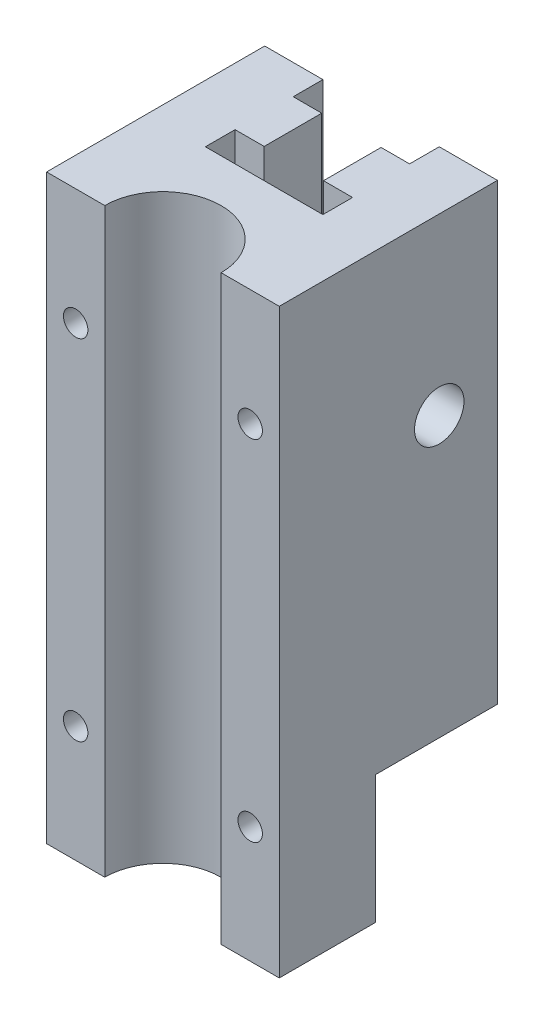
ISO-10303-21;
HEADER;
FILE_DESCRIPTION(('STEP AP214'),'2;1');
FILE_NAME('part.step','',(''),(''),'','','');
FILE_SCHEMA(('AUTOMOTIVE_DESIGN { 1 0 10303 214 1 1 1 1 }'));
ENDSEC;
DATA;
#1=APPLICATION_CONTEXT('core data for automotive mechanical design processes');
#2=APPLICATION_PROTOCOL_DEFINITION('international standard','automotive_design',2000,#1);
#3=PRODUCT_CONTEXT('',#1,'mechanical');
#4=PRODUCT('Part','Part','',(#3));
#5=PRODUCT_RELATED_PRODUCT_CATEGORY('part','',(#4));
#6=PRODUCT_DEFINITION_FORMATION('','',#4);
#7=PRODUCT_DEFINITION_CONTEXT('part definition',#1,'design');
#8=PRODUCT_DEFINITION('design','',#6,#7);
#9=PRODUCT_DEFINITION_SHAPE('','',#8);
#10=(LENGTH_UNIT() NAMED_UNIT(*) SI_UNIT(.MILLI.,.METRE.));
#11=(NAMED_UNIT(*) PLANE_ANGLE_UNIT() SI_UNIT($,.RADIAN.));
#12=(NAMED_UNIT(*) SI_UNIT($,.STERADIAN.) SOLID_ANGLE_UNIT());
#13=UNCERTAINTY_MEASURE_WITH_UNIT(LENGTH_MEASURE(1.E-05),#10,'distance_accuracy_value','');
#14=(GEOMETRIC_REPRESENTATION_CONTEXT(3) GLOBAL_UNCERTAINTY_ASSIGNED_CONTEXT((#13)) GLOBAL_UNIT_ASSIGNED_CONTEXT((#10,
#11,#12)) REPRESENTATION_CONTEXT('',''));
#15=CARTESIAN_POINT('',(0.,0.,0.));
#16=DIRECTION('',(0.,0.,1.));
#17=DIRECTION('',(1.,0.,0.));
#18=AXIS2_PLACEMENT_3D('',#15,#16,#17);
#19=CARTESIAN_POINT('',(-20.,-30.,10.));
#20=DIRECTION('',(1.,0.,0.));
#21=DIRECTION('',(0.,0.,-1.));
#22=AXIS2_PLACEMENT_3D('',#19,#20,#21);
#23=CYLINDRICAL_SURFACE('',#22,2.5);
#24=CARTESIAN_POINT('',(-5.1,-30.,10.));
#25=DIRECTION('',(-1.,0.,0.));
#26=DIRECTION('',(0.,0.,1.));
#27=AXIS2_PLACEMENT_3D('',#24,#25,#26);
#28=CIRCLE('',#27,2.5);
#29=CARTESIAN_POINT('',(-5.1,-30.,12.5));
#30=VERTEX_POINT('',#29);
#31=EDGE_CURVE('E340',#30,#30,#28,.T.);
#32=ORIENTED_EDGE('',*,*,#31,.F.);
#33=EDGE_LOOP('',(#32));
#34=FACE_BOUND('',#33,.T.);
#35=CARTESIAN_POINT('',(-17.,-30.,10.));
#36=DIRECTION('',(-1.,0.,0.));
#37=DIRECTION('',(0.,0.,1.));
#38=AXIS2_PLACEMENT_3D('',#35,#36,#37);
#39=CIRCLE('',#38,2.5);
#40=CARTESIAN_POINT('',(-17.,-30.,12.5));
#41=VERTEX_POINT('',#40);
#42=EDGE_CURVE('E249',#41,#41,#39,.T.);
#43=ORIENTED_EDGE('',*,*,#42,.T.);
#44=EDGE_LOOP('',(#43));
#45=FACE_BOUND('',#44,.T.);
#46=ADVANCED_FACE('F43',(#34,#45),#23,.F.);
#47=CARTESIAN_POINT('',(5.1,-30.,10.));
#48=DIRECTION('',(-1.,0.,0.));
#49=DIRECTION('',(0.,0.,1.));
#50=AXIS2_PLACEMENT_3D('',#47,#48,#49);
#51=CIRCLE('',#50,2.5);
#52=CARTESIAN_POINT('',(5.1,-30.,12.5));
#53=VERTEX_POINT('',#52);
#54=EDGE_CURVE('E333',#53,#53,#51,.T.);
#55=ORIENTED_EDGE('',*,*,#54,.T.);
#56=EDGE_LOOP('',(#55));
#57=FACE_BOUND('',#56,.T.);
#58=CARTESIAN_POINT('',(14.,-30.,10.));
#59=DIRECTION('',(1.,0.,0.));
#60=DIRECTION('',(0.,0.,-1.));
#61=AXIS2_PLACEMENT_3D('',#58,#59,#60);
#62=CIRCLE('',#61,2.5);
#63=CARTESIAN_POINT('',(14.,-30.,7.5));
#64=VERTEX_POINT('',#63);
#65=EDGE_CURVE('E325',#64,#64,#62,.T.);
#66=ORIENTED_EDGE('',*,*,#65,.T.);
#67=EDGE_LOOP('',(#66));
#68=FACE_BOUND('',#67,.T.);
#69=ADVANCED_FACE('F592',(#57,#68),#23,.F.);
#70=CARTESIAN_POINT('',(0.,-100.,0.));
#71=DIRECTION('',(0.,0.,-1.));
#72=DIRECTION('',(-1.,0.,0.));
#73=AXIS2_PLACEMENT_3D('',#70,#71,#72);
#74=PLANE('',#73);
#75=DIRECTION('',(0.,1.,0.));
#76=VECTOR('',#75,1.);
#77=CARTESIAN_POINT('',(-10.,-100.,0.));
#78=LINE('',#77,#76);
#79=CARTESIAN_POINT('',(-10.,-78.,0.));
#80=VERTEX_POINT('',#79);
#81=CARTESIAN_POINT('',(-10.,0.,0.));
#82=VERTEX_POINT('',#81);
#83=EDGE_CURVE('E496',#80,#82,#78,.T.);
#84=ORIENTED_EDGE('',*,*,#83,.F.);
#85=DIRECTION('',(1.,0.,0.));
#86=VECTOR('',#85,1.);
#87=CARTESIAN_POINT('',(20.,-78.,0.));
#88=LINE('',#87,#86);
#89=CARTESIAN_POINT('',(-20.,-78.,0.));
#90=VERTEX_POINT('',#89);
#91=EDGE_CURVE('E357',#90,#80,#88,.T.);
#92=ORIENTED_EDGE('',*,*,#91,.F.);
#93=DIRECTION('',(0.,1.,0.));
#94=VECTOR('',#93,1.);
#95=CARTESIAN_POINT('',(-20.,-100.,0.));
#96=LINE('',#95,#94);
#97=CARTESIAN_POINT('',(-20.,0.,0.));
#98=VERTEX_POINT('',#97);
#99=EDGE_CURVE('E493',#90,#98,#96,.T.);
#100=ORIENTED_EDGE('',*,*,#99,.T.);
#101=DIRECTION('',(-1.,0.,0.));
#102=VECTOR('',#101,1.);
#103=CARTESIAN_POINT('',(0.,0.,0.));
#104=LINE('',#103,#102);
#105=EDGE_CURVE('E483',#82,#98,#104,.T.);
#106=ORIENTED_EDGE('',*,*,#105,.F.);
#107=EDGE_LOOP('',(#84,#92,#100,#106));
#108=FACE_BOUND('',#107,.T.);
#109=ADVANCED_FACE('F598',(#108),#74,.T.);
#110=CARTESIAN_POINT('',(-10.,-100.,0.));
#111=DIRECTION('',(-1.,0.,0.));
#112=DIRECTION('',(0.,0.,1.));
#113=AXIS2_PLACEMENT_3D('',#110,#111,#112);
#114=PLANE('',#113);
#115=DIRECTION('',(0.,0.,1.));
#116=VECTOR('',#115,1.);
#117=CARTESIAN_POINT('',(-10.,-78.,0.));
#118=LINE('',#117,#116);
#119=CARTESIAN_POINT('',(-10.,-78.,5.1));
#120=VERTEX_POINT('',#119);
#121=EDGE_CURVE('E404',#80,#120,#118,.T.);
#122=ORIENTED_EDGE('',*,*,#121,.F.);
#123=ORIENTED_EDGE('',*,*,#83,.T.);
#124=DIRECTION('',(0.,0.,1.));
#125=VECTOR('',#124,1.);
#126=CARTESIAN_POINT('',(-10.,0.,0.));
#127=LINE('',#126,#125);
#128=CARTESIAN_POINT('',(-10.,0.,5.1));
#129=VERTEX_POINT('',#128);
#130=EDGE_CURVE('E479',#82,#129,#127,.T.);
#131=ORIENTED_EDGE('',*,*,#130,.T.);
#132=DIRECTION('',(0.,1.,0.));
#133=VECTOR('',#132,1.);
#134=CARTESIAN_POINT('',(-10.,-100.,5.1));
#135=LINE('',#134,#133);
#136=EDGE_CURVE('E499',#120,#129,#135,.T.);
#137=ORIENTED_EDGE('',*,*,#136,.F.);
#138=EDGE_LOOP('',(#122,#123,#131,#137));
#139=FACE_BOUND('',#138,.T.);
#140=ADVANCED_FACE('F812',(#139),#114,.F.);
#141=CARTESIAN_POINT('',(0.,-100.,5.1));
#142=DIRECTION('',(0.,0.,1.));
#143=DIRECTION('',(1.,0.,0.));
#144=AXIS2_PLACEMENT_3D('',#141,#142,#143);
#145=PLANE('',#144);
#146=DIRECTION('',(1.,0.,0.));
#147=VECTOR('',#146,1.);
#148=CARTESIAN_POINT('',(0.,-78.,5.1));
#149=LINE('',#148,#147);
#150=CARTESIAN_POINT('',(-5.1,-78.,5.1));
#151=VERTEX_POINT('',#150);
#152=EDGE_CURVE('E401',#120,#151,#149,.T.);
#153=ORIENTED_EDGE('',*,*,#152,.F.);
#154=ORIENTED_EDGE('',*,*,#136,.T.);
#155=DIRECTION('',(1.,0.,0.));
#156=VECTOR('',#155,1.);
#157=CARTESIAN_POINT('',(0.,0.,5.1));
#158=LINE('',#157,#156);
#159=CARTESIAN_POINT('',(-5.1,0.,5.1));
#160=VERTEX_POINT('',#159);
#161=EDGE_CURVE('E475',#129,#160,#158,.T.);
#162=ORIENTED_EDGE('',*,*,#161,.T.);
#163=DIRECTION('',(0.,1.,0.));
#164=VECTOR('',#163,1.);
#165=CARTESIAN_POINT('',(-5.1,-100.,5.1));
#166=LINE('',#165,#164);
#167=EDGE_CURVE('E502',#151,#160,#166,.T.);
#168=ORIENTED_EDGE('',*,*,#167,.F.);
#169=EDGE_LOOP('',(#153,#154,#162,#168));
#170=FACE_BOUND('',#169,.T.);
#171=ADVANCED_FACE('F821',(#170),#145,.F.);
#172=CARTESIAN_POINT('',(-5.1,-100.,0.));
#173=DIRECTION('',(-1.,0.,0.));
#174=DIRECTION('',(0.,0.,1.));
#175=AXIS2_PLACEMENT_3D('',#172,#173,#174);
#176=PLANE('',#175);
#177=ORIENTED_EDGE('',*,*,#31,.T.);
#178=EDGE_LOOP('',(#177));
#179=FACE_BOUND('',#178,.T.);
#180=DIRECTION('',(0.,0.,1.));
#181=VECTOR('',#180,1.);
#182=CARTESIAN_POINT('',(-5.1,-78.,0.));
#183=LINE('',#182,#181);
#184=CARTESIAN_POINT('',(-5.1,-78.,15.));
#185=VERTEX_POINT('',#184);
#186=EDGE_CURVE('E398',#151,#185,#183,.T.);
#187=ORIENTED_EDGE('',*,*,#186,.F.);
#188=ORIENTED_EDGE('',*,*,#167,.T.);
#189=DIRECTION('',(0.,0.,1.));
#190=VECTOR('',#189,1.);
#191=CARTESIAN_POINT('',(-5.1,0.,0.));
#192=LINE('',#191,#190);
#193=CARTESIAN_POINT('',(-5.1,0.,15.));
#194=VERTEX_POINT('',#193);
#195=EDGE_CURVE('E471',#160,#194,#192,.T.);
#196=ORIENTED_EDGE('',*,*,#195,.T.);
#197=DIRECTION('',(0.,1.,0.));
#198=VECTOR('',#197,1.);
#199=CARTESIAN_POINT('',(-5.1,-100.,15.));
#200=LINE('',#199,#198);
#201=EDGE_CURVE('E505',#185,#194,#200,.T.);
#202=ORIENTED_EDGE('',*,*,#201,.F.);
#203=EDGE_LOOP('',(#187,#188,#196,#202));
#204=FACE_BOUND('',#203,.T.);
#205=ADVANCED_FACE('F830',(#179,#204),#176,.F.);
#206=CARTESIAN_POINT('',(0.,-100.,15.));
#207=DIRECTION('',(0.,0.,-1.));
#208=DIRECTION('',(-1.,0.,0.));
#209=AXIS2_PLACEMENT_3D('',#206,#207,#208);
#210=PLANE('',#209);
#211=DIRECTION('',(-1.,0.,0.));
#212=VECTOR('',#211,1.);
#213=CARTESIAN_POINT('',(0.,-78.,15.));
#214=LINE('',#213,#212);
#215=CARTESIAN_POINT('',(-10.1,-78.,15.));
#216=VERTEX_POINT('',#215);
#217=EDGE_CURVE('E395',#185,#216,#214,.T.);
#218=ORIENTED_EDGE('',*,*,#217,.F.);
#219=ORIENTED_EDGE('',*,*,#201,.T.);
#220=DIRECTION('',(-1.,0.,0.));
#221=VECTOR('',#220,1.);
#222=CARTESIAN_POINT('',(0.,0.,15.));
#223=LINE('',#222,#221);
#224=CARTESIAN_POINT('',(-10.1,0.,15.));
#225=VERTEX_POINT('',#224);
#226=EDGE_CURVE('E467',#194,#225,#223,.T.);
#227=ORIENTED_EDGE('',*,*,#226,.T.);
#228=DIRECTION('',(0.,1.,0.));
#229=VECTOR('',#228,1.);
#230=CARTESIAN_POINT('',(-10.1,-100.,15.));
#231=LINE('',#230,#229);
#232=EDGE_CURVE('E508',#216,#225,#231,.T.);
#233=ORIENTED_EDGE('',*,*,#232,.F.);
#234=EDGE_LOOP('',(#218,#219,#227,#233));
#235=FACE_BOUND('',#234,.T.);
#236=ADVANCED_FACE('F839',(#235),#210,.F.);
#237=CARTESIAN_POINT('',(-10.1,-100.,0.));
#238=DIRECTION('',(-1.,0.,0.));
#239=DIRECTION('',(0.,0.,1.));
#240=AXIS2_PLACEMENT_3D('',#237,#238,#239);
#241=PLANE('',#240);
#242=DIRECTION('',(0.,0.,1.));
#243=VECTOR('',#242,1.);
#244=CARTESIAN_POINT('',(-10.1,-78.,0.));
#245=LINE('',#244,#243);
#246=CARTESIAN_POINT('',(-10.1,-78.,20.1));
#247=VERTEX_POINT('',#246);
#248=EDGE_CURVE('E392',#216,#247,#245,.T.);
#249=ORIENTED_EDGE('',*,*,#248,.F.);
#250=ORIENTED_EDGE('',*,*,#232,.T.);
#251=DIRECTION('',(0.,0.,1.));
#252=VECTOR('',#251,1.);
#253=CARTESIAN_POINT('',(-10.1,0.,0.));
#254=LINE('',#253,#252);
#255=CARTESIAN_POINT('',(-10.1,0.,20.1));
#256=VERTEX_POINT('',#255);
#257=EDGE_CURVE('E463',#225,#256,#254,.T.);
#258=ORIENTED_EDGE('',*,*,#257,.T.);
#259=DIRECTION('',(0.,1.,0.));
#260=VECTOR('',#259,1.);
#261=CARTESIAN_POINT('',(-10.1,-100.,20.1));
#262=LINE('',#261,#260);
#263=EDGE_CURVE('E511',#247,#256,#262,.T.);
#264=ORIENTED_EDGE('',*,*,#263,.F.);
#265=EDGE_LOOP('',(#249,#250,#258,#264));
#266=FACE_BOUND('',#265,.T.);
#267=ADVANCED_FACE('F847',(#266),#241,.F.);
#268=CARTESIAN_POINT('',(0.,-100.,20.1));
#269=DIRECTION('',(0.,0.,-1.));
#270=DIRECTION('',(-1.,0.,0.));
#271=AXIS2_PLACEMENT_3D('',#268,#269,#270);
#272=PLANE('',#271);
#273=DIRECTION('',(0.,1.,0.));
#274=VECTOR('',#273,1.);
#275=CARTESIAN_POINT('',(10.1,-100.,20.1));
#276=LINE('',#275,#274);
#277=CARTESIAN_POINT('',(10.1,-78.,20.1));
#278=VERTEX_POINT('',#277);
#279=CARTESIAN_POINT('',(10.1,0.,20.1));
#280=VERTEX_POINT('',#279);
#281=EDGE_CURVE('E514',#278,#280,#276,.T.);
#282=ORIENTED_EDGE('',*,*,#281,.F.);
#283=DIRECTION('',(-1.,0.,0.));
#284=VECTOR('',#283,1.);
#285=CARTESIAN_POINT('',(0.,-78.,20.1));
#286=LINE('',#285,#284);
#287=EDGE_CURVE('E388',#278,#247,#286,.T.);
#288=ORIENTED_EDGE('',*,*,#287,.T.);
#289=ORIENTED_EDGE('',*,*,#263,.T.);
#290=DIRECTION('',(-1.,0.,0.));
#291=VECTOR('',#290,1.);
#292=CARTESIAN_POINT('',(0.,0.,20.1));
#293=LINE('',#292,#291);
#294=EDGE_CURVE('E459',#280,#256,#293,.T.);
#295=ORIENTED_EDGE('',*,*,#294,.F.);
#296=EDGE_LOOP('',(#282,#288,#289,#295));
#297=FACE_BOUND('',#296,.T.);
#298=ADVANCED_FACE('F856',(#297),#272,.T.);
#299=CARTESIAN_POINT('',(10.1,-100.,0.));
#300=DIRECTION('',(-1.,0.,0.));
#301=DIRECTION('',(0.,0.,1.));
#302=AXIS2_PLACEMENT_3D('',#299,#300,#301);
#303=PLANE('',#302);
#304=DIRECTION('',(0.,1.,0.));
#305=VECTOR('',#304,1.);
#306=CARTESIAN_POINT('',(10.1,-100.,15.));
#307=LINE('',#306,#305);
#308=CARTESIAN_POINT('',(10.1,-78.,15.));
#309=VERTEX_POINT('',#308);
#310=CARTESIAN_POINT('',(10.1,0.,15.));
#311=VERTEX_POINT('',#310);
#312=EDGE_CURVE('E517',#309,#311,#307,.T.);
#313=ORIENTED_EDGE('',*,*,#312,.F.);
#314=DIRECTION('',(0.,0.,1.));
#315=VECTOR('',#314,1.);
#316=CARTESIAN_POINT('',(10.1,-78.,0.));
#317=LINE('',#316,#315);
#318=EDGE_CURVE('E384',#309,#278,#317,.T.);
#319=ORIENTED_EDGE('',*,*,#318,.T.);
#320=ORIENTED_EDGE('',*,*,#281,.T.);
#321=DIRECTION('',(0.,0.,1.));
#322=VECTOR('',#321,1.);
#323=CARTESIAN_POINT('',(10.1,0.,0.));
#324=LINE('',#323,#322);
#325=EDGE_CURVE('E455',#311,#280,#324,.T.);
#326=ORIENTED_EDGE('',*,*,#325,.F.);
#327=EDGE_LOOP('',(#313,#319,#320,#326));
#328=FACE_BOUND('',#327,.T.);
#329=ADVANCED_FACE('F865',(#328),#303,.T.);
#330=CARTESIAN_POINT('',(0.,-100.,15.));
#331=DIRECTION('',(0.,0.,1.));
#332=DIRECTION('',(1.,0.,0.));
#333=AXIS2_PLACEMENT_3D('',#330,#331,#332);
#334=PLANE('',#333);
#335=DIRECTION('',(0.,1.,0.));
#336=VECTOR('',#335,1.);
#337=CARTESIAN_POINT('',(5.1,-100.,15.));
#338=LINE('',#337,#336);
#339=CARTESIAN_POINT('',(5.1,-78.,15.));
#340=VERTEX_POINT('',#339);
#341=CARTESIAN_POINT('',(5.1,0.,15.));
#342=VERTEX_POINT('',#341);
#343=EDGE_CURVE('E520',#340,#342,#338,.T.);
#344=ORIENTED_EDGE('',*,*,#343,.F.);
#345=DIRECTION('',(1.,0.,0.));
#346=VECTOR('',#345,1.);
#347=CARTESIAN_POINT('',(0.,-78.,15.));
#348=LINE('',#347,#346);
#349=EDGE_CURVE('E380',#340,#309,#348,.T.);
#350=ORIENTED_EDGE('',*,*,#349,.T.);
#351=ORIENTED_EDGE('',*,*,#312,.T.);
#352=DIRECTION('',(1.,0.,0.));
#353=VECTOR('',#352,1.);
#354=CARTESIAN_POINT('',(0.,0.,15.));
#355=LINE('',#354,#353);
#356=EDGE_CURVE('E451',#342,#311,#355,.T.);
#357=ORIENTED_EDGE('',*,*,#356,.F.);
#358=EDGE_LOOP('',(#344,#350,#351,#357));
#359=FACE_BOUND('',#358,.T.);
#360=ADVANCED_FACE('F874',(#359),#334,.T.);
#361=CARTESIAN_POINT('',(5.1,-100.,0.));
#362=DIRECTION('',(-1.,0.,0.));
#363=DIRECTION('',(0.,0.,1.));
#364=AXIS2_PLACEMENT_3D('',#361,#362,#363);
#365=PLANE('',#364);
#366=ORIENTED_EDGE('',*,*,#54,.F.);
#367=EDGE_LOOP('',(#366));
#368=FACE_BOUND('',#367,.T.);
#369=DIRECTION('',(0.,1.,0.));
#370=VECTOR('',#369,1.);
#371=CARTESIAN_POINT('',(5.1,-100.,5.1));
#372=LINE('',#371,#370);
#373=CARTESIAN_POINT('',(5.1,-78.,5.1));
#374=VERTEX_POINT('',#373);
#375=CARTESIAN_POINT('',(5.1,0.,5.1));
#376=VERTEX_POINT('',#375);
#377=EDGE_CURVE('E523',#374,#376,#372,.T.);
#378=ORIENTED_EDGE('',*,*,#377,.F.);
#379=DIRECTION('',(0.,0.,1.));
#380=VECTOR('',#379,1.);
#381=CARTESIAN_POINT('',(5.1,-78.,0.));
#382=LINE('',#381,#380);
#383=EDGE_CURVE('E376',#374,#340,#382,.T.);
#384=ORIENTED_EDGE('',*,*,#383,.T.);
#385=ORIENTED_EDGE('',*,*,#343,.T.);
#386=DIRECTION('',(0.,0.,1.));
#387=VECTOR('',#386,1.);
#388=CARTESIAN_POINT('',(5.1,0.,0.));
#389=LINE('',#388,#387);
#390=EDGE_CURVE('E447',#376,#342,#389,.T.);
#391=ORIENTED_EDGE('',*,*,#390,.F.);
#392=EDGE_LOOP('',(#378,#384,#385,#391));
#393=FACE_BOUND('',#392,.T.);
#394=ADVANCED_FACE('F883',(#368,#393),#365,.T.);
#395=CARTESIAN_POINT('',(0.,-100.,5.1));
#396=DIRECTION('',(0.,0.,-1.));
#397=DIRECTION('',(-1.,0.,0.));
#398=AXIS2_PLACEMENT_3D('',#395,#396,#397);
#399=PLANE('',#398);
#400=DIRECTION('',(0.,1.,0.));
#401=VECTOR('',#400,1.);
#402=CARTESIAN_POINT('',(10.,-100.,5.1));
#403=LINE('',#402,#401);
#404=CARTESIAN_POINT('',(10.,-78.,5.1));
#405=VERTEX_POINT('',#404);
#406=CARTESIAN_POINT('',(10.,0.,5.1));
#407=VERTEX_POINT('',#406);
#408=EDGE_CURVE('E526',#405,#407,#403,.T.);
#409=ORIENTED_EDGE('',*,*,#408,.F.);
#410=DIRECTION('',(-1.,0.,0.));
#411=VECTOR('',#410,1.);
#412=CARTESIAN_POINT('',(0.,-78.,5.1));
#413=LINE('',#412,#411);
#414=EDGE_CURVE('E372',#405,#374,#413,.T.);
#415=ORIENTED_EDGE('',*,*,#414,.T.);
#416=ORIENTED_EDGE('',*,*,#377,.T.);
#417=DIRECTION('',(-1.,0.,0.));
#418=VECTOR('',#417,1.);
#419=CARTESIAN_POINT('',(0.,0.,5.1));
#420=LINE('',#419,#418);
#421=EDGE_CURVE('E443',#407,#376,#420,.T.);
#422=ORIENTED_EDGE('',*,*,#421,.F.);
#423=EDGE_LOOP('',(#409,#415,#416,#422));
#424=FACE_BOUND('',#423,.T.);
#425=ADVANCED_FACE('F892',(#424),#399,.T.);
#426=CARTESIAN_POINT('',(10.,-100.,0.));
#427=DIRECTION('',(-1.,0.,0.));
#428=DIRECTION('',(0.,0.,1.));
#429=AXIS2_PLACEMENT_3D('',#426,#427,#428);
#430=PLANE('',#429);
#431=DIRECTION('',(0.,1.,0.));
#432=VECTOR('',#431,1.);
#433=CARTESIAN_POINT('',(10.,-100.,0.));
#434=LINE('',#433,#432);
#435=CARTESIAN_POINT('',(10.,-78.,0.));
#436=VERTEX_POINT('',#435);
#437=CARTESIAN_POINT('',(10.,0.,0.));
#438=VERTEX_POINT('',#437);
#439=EDGE_CURVE('E529',#436,#438,#434,.T.);
#440=ORIENTED_EDGE('',*,*,#439,.F.);
#441=DIRECTION('',(0.,0.,1.));
#442=VECTOR('',#441,1.);
#443=CARTESIAN_POINT('',(10.,-78.,0.));
#444=LINE('',#443,#442);
#445=EDGE_CURVE('E366',#436,#405,#444,.T.);
#446=ORIENTED_EDGE('',*,*,#445,.T.);
#447=ORIENTED_EDGE('',*,*,#408,.T.);
#448=DIRECTION('',(0.,0.,1.));
#449=VECTOR('',#448,1.);
#450=CARTESIAN_POINT('',(10.,0.,0.));
#451=LINE('',#450,#449);
#452=EDGE_CURVE('E439',#438,#407,#451,.T.);
#453=ORIENTED_EDGE('',*,*,#452,.F.);
#454=EDGE_LOOP('',(#440,#446,#447,#453));
#455=FACE_BOUND('',#454,.T.);
#456=ADVANCED_FACE('F900',(#455),#430,.T.);
#457=CARTESIAN_POINT('',(0.,-100.,0.));
#458=DIRECTION('',(0.,0.,-1.));
#459=DIRECTION('',(-1.,0.,0.));
#460=AXIS2_PLACEMENT_3D('',#457,#458,#459);
#461=PLANE('',#460);
#462=DIRECTION('',(0.,1.,0.));
#463=VECTOR('',#462,1.);
#464=CARTESIAN_POINT('',(20.,-100.,0.));
#465=LINE('',#464,#463);
#466=CARTESIAN_POINT('',(20.,-78.,0.));
#467=VERTEX_POINT('',#466);
#468=CARTESIAN_POINT('',(20.,0.,0.));
#469=VERTEX_POINT('',#468);
#470=EDGE_CURVE('E532',#467,#469,#465,.T.);
#471=ORIENTED_EDGE('',*,*,#470,.F.);
#472=EDGE_CURVE('E356',#436,#467,#88,.T.);
#473=ORIENTED_EDGE('',*,*,#472,.F.);
#474=ORIENTED_EDGE('',*,*,#439,.T.);
#475=DIRECTION('',(-1.,0.,0.));
#476=VECTOR('',#475,1.);
#477=CARTESIAN_POINT('',(0.,0.,0.));
#478=LINE('',#477,#476);
#479=EDGE_CURVE('E435',#469,#438,#478,.T.);
#480=ORIENTED_EDGE('',*,*,#479,.F.);
#481=EDGE_LOOP('',(#471,#473,#474,#480));
#482=FACE_BOUND('',#481,.T.);
#483=ADVANCED_FACE('F572',(#482),#461,.T.);
#484=CARTESIAN_POINT('',(0.,-100.,37.5));
#485=DIRECTION('',(0.,1.,0.));
#486=DIRECTION('',(0.,0.,1.));
#487=AXIS2_PLACEMENT_3D('',#484,#485,#486);
#488=CYLINDRICAL_SURFACE('',#487,10.);
#489=CARTESIAN_POINT('',(0.,0.,37.5));
#490=DIRECTION('',(0.,1.,0.));
#491=DIRECTION('',(0.,0.,1.));
#492=AXIS2_PLACEMENT_3D('',#489,#490,#491);
#493=CIRCLE('',#492,10.);
#494=CARTESIAN_POINT('',(10.,0.,37.5));
#495=VERTEX_POINT('',#494);
#496=CARTESIAN_POINT('',(-10.,0.,37.5));
#497=VERTEX_POINT('',#496);
#498=EDGE_CURVE('E407',#495,#497,#493,.T.);
#499=ORIENTED_EDGE('',*,*,#498,.T.);
#500=DIRECTION('',(0.,1.,0.));
#501=VECTOR('',#500,1.);
#502=CARTESIAN_POINT('',(-10.,-100.,37.5));
#503=LINE('',#502,#501);
#504=CARTESIAN_POINT('',(-10.,-100.,37.5));
#505=VERTEX_POINT('',#504);
#506=EDGE_CURVE('E11',#505,#497,#503,.T.);
#507=ORIENTED_EDGE('',*,*,#506,.F.);
#508=CARTESIAN_POINT('',(0.,-100.,37.5));
#509=DIRECTION('',(0.,1.,0.));
#510=DIRECTION('',(0.,0.,1.));
#511=AXIS2_PLACEMENT_3D('',#508,#509,#510);
#512=CIRCLE('',#511,10.);
#513=CARTESIAN_POINT('',(10.,-100.,37.5));
#514=VERTEX_POINT('',#513);
#515=EDGE_CURVE('E408',#514,#505,#512,.T.);
#516=ORIENTED_EDGE('',*,*,#515,.F.);
#517=DIRECTION('',(0.,1.,0.));
#518=VECTOR('',#517,1.);
#519=CARTESIAN_POINT('',(10.,-100.,37.5));
#520=LINE('',#519,#518);
#521=EDGE_CURVE('E47',#514,#495,#520,.T.);
#522=ORIENTED_EDGE('',*,*,#521,.T.);
#523=EDGE_LOOP('',(#499,#507,#516,#522));
#524=FACE_BOUND('',#523,.T.);
#525=ADVANCED_FACE('F45',(#524),#488,.F.);
#526=CARTESIAN_POINT('',(0.,-100.,37.5));
#527=DIRECTION('',(0.,0.,1.));
#528=DIRECTION('',(1.,0.,0.));
#529=AXIS2_PLACEMENT_3D('',#526,#527,#528);
#530=PLANE('',#529);
#531=CARTESIAN_POINT('',(-15.,-80.,37.5));
#532=DIRECTION('',(0.,0.,1.));
#533=DIRECTION('',(1.,0.,0.));
#534=AXIS2_PLACEMENT_3D('',#531,#532,#533);
#535=CIRCLE('',#534,2.1);
#536=CARTESIAN_POINT('',(-12.9,-80.,37.5));
#537=VERTEX_POINT('',#536);
#538=EDGE_CURVE('E310',#537,#537,#535,.T.);
#539=ORIENTED_EDGE('',*,*,#538,.F.);
#540=EDGE_LOOP('',(#539));
#541=FACE_BOUND('',#540,.T.);
#542=CARTESIAN_POINT('',(-15.,-20.,37.5));
#543=DIRECTION('',(0.,0.,1.));
#544=DIRECTION('',(1.,0.,0.));
#545=AXIS2_PLACEMENT_3D('',#542,#543,#544);
#546=CIRCLE('',#545,2.1);
#547=CARTESIAN_POINT('',(-12.9,-20.,37.5));
#548=VERTEX_POINT('',#547);
#549=EDGE_CURVE('E297',#548,#548,#546,.T.);
#550=ORIENTED_EDGE('',*,*,#549,.F.);
#551=EDGE_LOOP('',(#550));
#552=FACE_BOUND('',#551,.T.);
#553=DIRECTION('',(1.,0.,0.));
#554=VECTOR('',#553,1.);
#555=CARTESIAN_POINT('',(0.,0.,37.5));
#556=LINE('',#555,#554);
#557=CARTESIAN_POINT('',(-20.,0.,37.5));
#558=VERTEX_POINT('',#557);
#559=EDGE_CURVE('E412',#558,#497,#556,.T.);
#560=ORIENTED_EDGE('',*,*,#559,.F.);
#561=DIRECTION('',(0.,1.,0.));
#562=VECTOR('',#561,1.);
#563=CARTESIAN_POINT('',(-20.,-100.,37.5));
#564=LINE('',#563,#562);
#565=CARTESIAN_POINT('',(-20.,-100.,37.5));
#566=VERTEX_POINT('',#565);
#567=EDGE_CURVE('E53',#566,#558,#564,.T.);
#568=ORIENTED_EDGE('',*,*,#567,.F.);
#569=DIRECTION('',(1.,0.,0.));
#570=VECTOR('',#569,1.);
#571=CARTESIAN_POINT('',(0.,-100.,37.5));
#572=LINE('',#571,#570);
#573=EDGE_CURVE('E417',#566,#505,#572,.T.);
#574=ORIENTED_EDGE('',*,*,#573,.T.);
#575=ORIENTED_EDGE('',*,*,#506,.T.);
#576=EDGE_LOOP('',(#560,#568,#574,#575));
#577=FACE_BOUND('',#576,.T.);
#578=ADVANCED_FACE('F549',(#541,#552,#577),#530,.T.);
#579=CARTESIAN_POINT('',(-20.,-100.,0.));
#580=DIRECTION('',(-1.,0.,0.));
#581=DIRECTION('',(0.,0.,1.));
#582=AXIS2_PLACEMENT_3D('',#579,#580,#581);
#583=PLANE('',#582);
#584=DIRECTION('',(0.,0.874642714171317,0.484768112139228));
#585=VECTOR('',#584,1.);
#586=CARTESIAN_POINT('',(-20.,-33.,11.802775637732));
#587=LINE('',#586,#585);
#588=CARTESIAN_POINT('',(-20.,-33.,11.802775637732));
#589=VERTEX_POINT('',#588);
#590=CARTESIAN_POINT('',(-20.,-29.9387505004004,13.4994640302193));
#591=VERTEX_POINT('',#590);
#592=EDGE_CURVE('E61',#589,#591,#587,.T.);
#593=ORIENTED_EDGE('',*,*,#592,.F.);
#594=DIRECTION('',(0.,0.0174998570284642,0.999846865776946));
#595=VECTOR('',#594,1.);
#596=CARTESIAN_POINT('',(-20.,-33.0612494995996,8.3033116075127));
#597=LINE('',#596,#595);
#598=CARTESIAN_POINT('',(-20.,-33.0612494995996,8.3033116075127));
#599=VERTEX_POINT('',#598);
#600=EDGE_CURVE('E242',#599,#589,#597,.T.);
#601=ORIENTED_EDGE('',*,*,#600,.F.);
#602=DIRECTION('',(0.,-0.857142857142854,0.515078753637718));
#603=VECTOR('',#602,1.);
#604=CARTESIAN_POINT('',(-20.,-30.0612494995996,6.50053596978068));
#605=LINE('',#604,#603);
#606=CARTESIAN_POINT('',(-20.,-30.0612494995996,6.50053596978068));
#607=VERTEX_POINT('',#606);
#608=EDGE_CURVE('E246',#607,#599,#605,.T.);
#609=ORIENTED_EDGE('',*,*,#608,.F.);
#610=DIRECTION('',(0.,-0.874642714171317,-0.484768112139228));
#611=VECTOR('',#610,1.);
#612=CARTESIAN_POINT('',(-20.,-27.,8.19722436226798));
#613=LINE('',#612,#611);
#614=CARTESIAN_POINT('',(-20.,-27.,8.19722436226798));
#615=VERTEX_POINT('',#614);
#616=EDGE_CURVE('E271',#615,#607,#613,.T.);
#617=ORIENTED_EDGE('',*,*,#616,.F.);
#618=DIRECTION('',(0.,-0.0174998570284632,-0.999846865776947));
#619=VECTOR('',#618,1.);
#620=CARTESIAN_POINT('',(-20.,-26.9387505004004,11.6966883924873));
#621=LINE('',#620,#619);
#622=CARTESIAN_POINT('',(-20.,-26.9387505004004,11.6966883924873));
#623=VERTEX_POINT('',#622);
#624=EDGE_CURVE('E267',#623,#615,#621,.T.);
#625=ORIENTED_EDGE('',*,*,#624,.F.);
#626=DIRECTION('',(0.,0.857142857142854,-0.515078753637719));
#627=VECTOR('',#626,1.);
#628=CARTESIAN_POINT('',(-20.,-29.9387505004004,13.4994640302193));
#629=LINE('',#628,#627);
#630=EDGE_CURVE('E264',#591,#623,#629,.T.);
#631=ORIENTED_EDGE('',*,*,#630,.F.);
#632=EDGE_LOOP('',(#593,#601,#609,#617,#625,#631));
#633=FACE_BOUND('',#632,.T.);
#634=DIRECTION('',(0.,-1.,0.));
#635=VECTOR('',#634,1.);
#636=CARTESIAN_POINT('',(-20.,-78.,21.));
#637=LINE('',#636,#635);
#638=CARTESIAN_POINT('',(-20.,-78.,21.));
#639=VERTEX_POINT('',#638);
#640=CARTESIAN_POINT('',(-20.,-100.,21.));
#641=VERTEX_POINT('',#640);
#642=EDGE_CURVE('E362',#639,#641,#637,.T.);
#643=ORIENTED_EDGE('',*,*,#642,.T.);
#644=DIRECTION('',(0.,0.,1.));
#645=VECTOR('',#644,1.);
#646=CARTESIAN_POINT('',(-20.,-100.,0.));
#647=LINE('',#646,#645);
#648=EDGE_CURVE('E421',#641,#566,#647,.T.);
#649=ORIENTED_EDGE('',*,*,#648,.T.);
#650=ORIENTED_EDGE('',*,*,#567,.T.);
#651=DIRECTION('',(0.,0.,1.));
#652=VECTOR('',#651,1.);
#653=CARTESIAN_POINT('',(-20.,0.,0.));
#654=LINE('',#653,#652);
#655=EDGE_CURVE('E487',#98,#558,#654,.T.);
#656=ORIENTED_EDGE('',*,*,#655,.F.);
#657=ORIENTED_EDGE('',*,*,#99,.F.);
#658=DIRECTION('',(0.,0.,-1.));
#659=VECTOR('',#658,1.);
#660=CARTESIAN_POINT('',(-20.,-78.,0.));
#661=LINE('',#660,#659);
#662=EDGE_CURVE('E353',#639,#90,#661,.T.);
#663=ORIENTED_EDGE('',*,*,#662,.F.);
#664=EDGE_LOOP('',(#643,#649,#650,#656,#657,#663));
#665=FACE_BOUND('',#664,.T.);
#666=ADVANCED_FACE('F583',(#633,#665),#583,.T.);
#667=CARTESIAN_POINT('',(20.,-100.,0.));
#668=DIRECTION('',(1.,0.,0.));
#669=DIRECTION('',(0.,0.,-1.));
#670=AXIS2_PLACEMENT_3D('',#667,#668,#669);
#671=PLANE('',#670);
#672=CARTESIAN_POINT('',(20.,-30.,10.));
#673=DIRECTION('',(1.,0.,0.));
#674=DIRECTION('',(0.,0.,-1.));
#675=AXIS2_PLACEMENT_3D('',#672,#673,#674);
#676=CIRCLE('',#675,4.25);
#677=CARTESIAN_POINT('',(20.,-30.,5.75));
#678=VERTEX_POINT('',#677);
#679=EDGE_CURVE('E321',#678,#678,#676,.T.);
#680=ORIENTED_EDGE('',*,*,#679,.F.);
#681=EDGE_LOOP('',(#680));
#682=FACE_BOUND('',#681,.T.);
#683=DIRECTION('',(0.,-1.,0.));
#684=VECTOR('',#683,1.);
#685=CARTESIAN_POINT('',(20.,-78.,21.));
#686=LINE('',#685,#684);
#687=CARTESIAN_POINT('',(20.,-78.,21.));
#688=VERTEX_POINT('',#687);
#689=CARTESIAN_POINT('',(20.,-100.,21.));
#690=VERTEX_POINT('',#689);
#691=EDGE_CURVE('E69',#688,#690,#686,.T.);
#692=ORIENTED_EDGE('',*,*,#691,.F.);
#693=DIRECTION('',(0.,0.,1.));
#694=VECTOR('',#693,1.);
#695=CARTESIAN_POINT('',(20.,-78.,0.));
#696=LINE('',#695,#694);
#697=EDGE_CURVE('E345',#467,#688,#696,.T.);
#698=ORIENTED_EDGE('',*,*,#697,.F.);
#699=ORIENTED_EDGE('',*,*,#470,.T.);
#700=DIRECTION('',(0.,0.,-1.));
#701=VECTOR('',#700,1.);
#702=CARTESIAN_POINT('',(20.,0.,0.));
#703=LINE('',#702,#701);
#704=CARTESIAN_POINT('',(20.,0.,37.5));
#705=VERTEX_POINT('',#704);
#706=EDGE_CURVE('E431',#705,#469,#703,.T.);
#707=ORIENTED_EDGE('',*,*,#706,.F.);
#708=DIRECTION('',(0.,1.,0.));
#709=VECTOR('',#708,1.);
#710=CARTESIAN_POINT('',(20.,-100.,37.5));
#711=LINE('',#710,#709);
#712=CARTESIAN_POINT('',(20.,-100.,37.5));
#713=VERTEX_POINT('',#712);
#714=EDGE_CURVE('E534',#713,#705,#711,.T.);
#715=ORIENTED_EDGE('',*,*,#714,.F.);
#716=DIRECTION('',(0.,0.,-1.));
#717=VECTOR('',#716,1.);
#718=CARTESIAN_POINT('',(20.,-100.,0.));
#719=LINE('',#718,#717);
#720=EDGE_CURVE('E416',#713,#690,#719,.T.);
#721=ORIENTED_EDGE('',*,*,#720,.T.);
#722=EDGE_LOOP('',(#692,#698,#699,#707,#715,#721));
#723=FACE_BOUND('',#722,.T.);
#724=ADVANCED_FACE('F570',(#682,#723),#671,.T.);
#725=CARTESIAN_POINT('',(15.,-80.,37.5));
#726=DIRECTION('',(0.,0.,1.));
#727=DIRECTION('',(1.,0.,0.));
#728=AXIS2_PLACEMENT_3D('',#725,#726,#727);
#729=CIRCLE('',#728,2.1);
#730=CARTESIAN_POINT('',(17.1,-80.,37.5));
#731=VERTEX_POINT('',#730);
#732=EDGE_CURVE('E302',#731,#731,#729,.T.);
#733=ORIENTED_EDGE('',*,*,#732,.F.);
#734=EDGE_LOOP('',(#733));
#735=FACE_BOUND('',#734,.T.);
#736=CARTESIAN_POINT('',(15.,-20.,37.5));
#737=DIRECTION('',(0.,0.,1.));
#738=DIRECTION('',(1.,0.,0.));
#739=AXIS2_PLACEMENT_3D('',#736,#737,#738);
#740=CIRCLE('',#739,2.1);
#741=CARTESIAN_POINT('',(17.1,-20.,37.5));
#742=VERTEX_POINT('',#741);
#743=EDGE_CURVE('E293',#742,#742,#740,.T.);
#744=ORIENTED_EDGE('',*,*,#743,.F.);
#745=EDGE_LOOP('',(#744));
#746=FACE_BOUND('',#745,.T.);
#747=EDGE_CURVE('E427',#495,#705,#556,.T.);
#748=ORIENTED_EDGE('',*,*,#747,.F.);
#749=ORIENTED_EDGE('',*,*,#521,.F.);
#750=EDGE_CURVE('E411',#514,#713,#572,.T.);
#751=ORIENTED_EDGE('',*,*,#750,.T.);
#752=ORIENTED_EDGE('',*,*,#714,.T.);
#753=EDGE_LOOP('',(#748,#749,#751,#752));
#754=FACE_BOUND('',#753,.T.);
#755=ADVANCED_FACE('F574',(#735,#746,#754),#530,.T.);
#756=CARTESIAN_POINT('',(0.,-100.,0.));
#757=DIRECTION('',(0.,1.,0.));
#758=DIRECTION('',(0.,0.,1.));
#759=AXIS2_PLACEMENT_3D('',#756,#757,#758);
#760=PLANE('',#759);
#761=ORIENTED_EDGE('',*,*,#648,.F.);
#762=DIRECTION('',(-1.,0.,0.));
#763=VECTOR('',#762,1.);
#764=CARTESIAN_POINT('',(20.,-100.,21.));
#765=LINE('',#764,#763);
#766=EDGE_CURVE('E344',#690,#641,#765,.T.);
#767=ORIENTED_EDGE('',*,*,#766,.F.);
#768=ORIENTED_EDGE('',*,*,#720,.F.);
#769=ORIENTED_EDGE('',*,*,#750,.F.);
#770=ORIENTED_EDGE('',*,*,#515,.T.);
#771=ORIENTED_EDGE('',*,*,#573,.F.);
#772=EDGE_LOOP('',(#761,#767,#768,#769,#770,#771));
#773=FACE_BOUND('',#772,.T.);
#774=ADVANCED_FACE('F553',(#773),#760,.F.);
#775=CARTESIAN_POINT('',(0.,0.,0.));
#776=DIRECTION('',(0.,1.,0.));
#777=DIRECTION('',(0.,0.,1.));
#778=AXIS2_PLACEMENT_3D('',#775,#776,#777);
#779=PLANE('',#778);
#780=ORIENTED_EDGE('',*,*,#498,.F.);
#781=ORIENTED_EDGE('',*,*,#747,.T.);
#782=ORIENTED_EDGE('',*,*,#706,.T.);
#783=ORIENTED_EDGE('',*,*,#479,.T.);
#784=ORIENTED_EDGE('',*,*,#452,.T.);
#785=ORIENTED_EDGE('',*,*,#421,.T.);
#786=ORIENTED_EDGE('',*,*,#390,.T.);
#787=ORIENTED_EDGE('',*,*,#356,.T.);
#788=ORIENTED_EDGE('',*,*,#325,.T.);
#789=ORIENTED_EDGE('',*,*,#294,.T.);
#790=ORIENTED_EDGE('',*,*,#257,.F.);
#791=ORIENTED_EDGE('',*,*,#226,.F.);
#792=ORIENTED_EDGE('',*,*,#195,.F.);
#793=ORIENTED_EDGE('',*,*,#161,.F.);
#794=ORIENTED_EDGE('',*,*,#130,.F.);
#795=ORIENTED_EDGE('',*,*,#105,.T.);
#796=ORIENTED_EDGE('',*,*,#655,.T.);
#797=ORIENTED_EDGE('',*,*,#559,.T.);
#798=EDGE_LOOP('',(#780,#781,#782,#783,#784,#785,#786,#787,#788,#789,#790,#791,#792,#793,#794,
#795,#796,#797));
#799=FACE_BOUND('',#798,.T.);
#800=ADVANCED_FACE('F558',(#799),#779,.T.);
#801=CARTESIAN_POINT('',(0.,-78.,0.));
#802=DIRECTION('',(0.,-1.,0.));
#803=DIRECTION('',(0.,0.,-1.));
#804=AXIS2_PLACEMENT_3D('',#801,#802,#803);
#805=PLANE('',#804);
#806=ORIENTED_EDGE('',*,*,#121,.T.);
#807=ORIENTED_EDGE('',*,*,#152,.T.);
#808=ORIENTED_EDGE('',*,*,#186,.T.);
#809=ORIENTED_EDGE('',*,*,#217,.T.);
#810=ORIENTED_EDGE('',*,*,#248,.T.);
#811=ORIENTED_EDGE('',*,*,#287,.F.);
#812=ORIENTED_EDGE('',*,*,#318,.F.);
#813=ORIENTED_EDGE('',*,*,#349,.F.);
#814=ORIENTED_EDGE('',*,*,#383,.F.);
#815=ORIENTED_EDGE('',*,*,#414,.F.);
#816=ORIENTED_EDGE('',*,*,#445,.F.);
#817=ORIENTED_EDGE('',*,*,#472,.T.);
#818=ORIENTED_EDGE('',*,*,#697,.T.);
#819=DIRECTION('',(-1.,0.,0.));
#820=VECTOR('',#819,1.);
#821=CARTESIAN_POINT('',(20.,-78.,21.));
#822=LINE('',#821,#820);
#823=EDGE_CURVE('E349',#688,#639,#822,.T.);
#824=ORIENTED_EDGE('',*,*,#823,.T.);
#825=ORIENTED_EDGE('',*,*,#662,.T.);
#826=ORIENTED_EDGE('',*,*,#91,.T.);
#827=EDGE_LOOP('',(#806,#807,#808,#809,#810,#811,#812,#813,#814,#815,#816,#817,#818,#824,#825,#826));
#828=FACE_BOUND('',#827,.T.);
#829=ADVANCED_FACE('F565',(#828),#805,.T.);
#830=CARTESIAN_POINT('',(20.,-78.,21.));
#831=DIRECTION('',(0.,0.,1.));
#832=DIRECTION('',(1.,0.,0.));
#833=AXIS2_PLACEMENT_3D('',#830,#831,#832);
#834=PLANE('',#833);
#835=ORIENTED_EDGE('',*,*,#766,.T.);
#836=ORIENTED_EDGE('',*,*,#642,.F.);
#837=ORIENTED_EDGE('',*,*,#823,.F.);
#838=ORIENTED_EDGE('',*,*,#691,.T.);
#839=EDGE_LOOP('',(#835,#836,#837,#838));
#840=FACE_BOUND('',#839,.T.);
#841=ADVANCED_FACE('F608',(#840),#834,.F.);
#842=CARTESIAN_POINT('',(14.,-30.,10.));
#843=DIRECTION('',(1.,0.,0.));
#844=DIRECTION('',(0.,0.,-1.));
#845=AXIS2_PLACEMENT_3D('',#842,#843,#844);
#846=CYLINDRICAL_SURFACE('',#845,4.25);
#847=CARTESIAN_POINT('',(14.,-30.,10.));
#848=DIRECTION('',(1.,0.,0.));
#849=DIRECTION('',(0.,0.,-1.));
#850=AXIS2_PLACEMENT_3D('',#847,#848,#849);
#851=CIRCLE('',#850,4.25);
#852=CARTESIAN_POINT('',(14.,-30.,5.75));
#853=VERTEX_POINT('',#852);
#854=EDGE_CURVE('E329',#853,#853,#851,.T.);
#855=ORIENTED_EDGE('',*,*,#854,.F.);
#856=EDGE_LOOP('',(#855));
#857=FACE_BOUND('',#856,.T.);
#858=ORIENTED_EDGE('',*,*,#679,.T.);
#859=EDGE_LOOP('',(#858));
#860=FACE_BOUND('',#859,.T.);
#861=ADVANCED_FACE('F604',(#857,#860),#846,.F.);
#862=CARTESIAN_POINT('',(14.,0.,0.));
#863=DIRECTION('',(1.,0.,0.));
#864=DIRECTION('',(0.,0.,-1.));
#865=AXIS2_PLACEMENT_3D('',#862,#863,#864);
#866=PLANE('',#865);
#867=ORIENTED_EDGE('',*,*,#65,.F.);
#868=EDGE_LOOP('',(#867));
#869=FACE_BOUND('',#868,.T.);
#870=ORIENTED_EDGE('',*,*,#854,.T.);
#871=EDGE_LOOP('',(#870));
#872=FACE_BOUND('',#871,.T.);
#873=ADVANCED_FACE('F632',(#869,#872),#866,.T.);
#874=CARTESIAN_POINT('',(15.,-20.,27.5));
#875=DIRECTION('',(0.,0.,1.));
#876=DIRECTION('',(1.,0.,0.));
#877=AXIS2_PLACEMENT_3D('',#874,#875,#876);
#878=CYLINDRICAL_SURFACE('',#877,2.1);
#879=CARTESIAN_POINT('',(15.,-20.,27.5));
#880=DIRECTION('',(0.,0.,1.));
#881=DIRECTION('',(1.,0.,0.));
#882=AXIS2_PLACEMENT_3D('',#879,#880,#881);
#883=CIRCLE('',#882,2.1);
#884=CARTESIAN_POINT('',(17.1,-20.,27.5));
#885=VERTEX_POINT('',#884);
#886=EDGE_CURVE('E298',#885,#885,#883,.T.);
#887=ORIENTED_EDGE('',*,*,#886,.F.);
#888=EDGE_LOOP('',(#887));
#889=FACE_BOUND('',#888,.T.);
#890=ORIENTED_EDGE('',*,*,#743,.T.);
#891=EDGE_LOOP('',(#890));
#892=FACE_BOUND('',#891,.T.);
#893=ADVANCED_FACE('F640',(#889,#892),#878,.F.);
#894=CARTESIAN_POINT('',(15.,-20.,27.5));
#895=DIRECTION('',(0.,0.,1.));
#896=DIRECTION('',(1.,0.,0.));
#897=AXIS2_PLACEMENT_3D('',#894,#895,#896);
#898=PLANE('',#897);
#899=ORIENTED_EDGE('',*,*,#886,.T.);
#900=EDGE_LOOP('',(#899));
#901=FACE_BOUND('',#900,.T.);
#902=ADVANCED_FACE('F648',(#901),#898,.T.);
#903=CARTESIAN_POINT('',(15.,-80.,27.5));
#904=DIRECTION('',(0.,0.,1.));
#905=DIRECTION('',(1.,0.,0.));
#906=AXIS2_PLACEMENT_3D('',#903,#904,#905);
#907=CYLINDRICAL_SURFACE('',#906,2.1);
#908=CARTESIAN_POINT('',(15.,-80.,27.5));
#909=DIRECTION('',(0.,0.,1.));
#910=DIRECTION('',(1.,0.,0.));
#911=AXIS2_PLACEMENT_3D('',#908,#909,#910);
#912=CIRCLE('',#911,2.1);
#913=CARTESIAN_POINT('',(17.1,-80.,27.5));
#914=VERTEX_POINT('',#913);
#915=EDGE_CURVE('E306',#914,#914,#912,.T.);
#916=ORIENTED_EDGE('',*,*,#915,.F.);
#917=EDGE_LOOP('',(#916));
#918=FACE_BOUND('',#917,.T.);
#919=ORIENTED_EDGE('',*,*,#732,.T.);
#920=EDGE_LOOP('',(#919));
#921=FACE_BOUND('',#920,.T.);
#922=ADVANCED_FACE('F656',(#918,#921),#907,.F.);
#923=CARTESIAN_POINT('',(15.,-80.,27.5));
#924=DIRECTION('',(0.,0.,1.));
#925=DIRECTION('',(1.,0.,0.));
#926=AXIS2_PLACEMENT_3D('',#923,#924,#925);
#927=PLANE('',#926);
#928=ORIENTED_EDGE('',*,*,#915,.T.);
#929=EDGE_LOOP('',(#928));
#930=FACE_BOUND('',#929,.T.);
#931=ADVANCED_FACE('F664',(#930),#927,.T.);
#932=CARTESIAN_POINT('',(-15.,-20.,27.5));
#933=DIRECTION('',(0.,0.,1.));
#934=DIRECTION('',(1.,0.,0.));
#935=AXIS2_PLACEMENT_3D('',#932,#933,#934);
#936=CYLINDRICAL_SURFACE('',#935,2.1);
#937=CARTESIAN_POINT('',(-15.,-20.,27.5));
#938=DIRECTION('',(0.,0.,1.));
#939=DIRECTION('',(1.,0.,0.));
#940=AXIS2_PLACEMENT_3D('',#937,#938,#939);
#941=CIRCLE('',#940,2.1);
#942=CARTESIAN_POINT('',(-12.9,-20.,27.5));
#943=VERTEX_POINT('',#942);
#944=EDGE_CURVE('E317',#943,#943,#941,.T.);
#945=ORIENTED_EDGE('',*,*,#944,.F.);
#946=EDGE_LOOP('',(#945));
#947=FACE_BOUND('',#946,.T.);
#948=ORIENTED_EDGE('',*,*,#549,.T.);
#949=EDGE_LOOP('',(#948));
#950=FACE_BOUND('',#949,.T.);
#951=ADVANCED_FACE('F672',(#947,#950),#936,.F.);
#952=CARTESIAN_POINT('',(-15.,-20.,27.5));
#953=DIRECTION('',(0.,0.,1.));
#954=DIRECTION('',(1.,0.,0.));
#955=AXIS2_PLACEMENT_3D('',#952,#953,#954);
#956=PLANE('',#955);
#957=ORIENTED_EDGE('',*,*,#944,.T.);
#958=EDGE_LOOP('',(#957));
#959=FACE_BOUND('',#958,.T.);
#960=ADVANCED_FACE('F680',(#959),#956,.T.);
#961=CARTESIAN_POINT('',(-15.,-80.,27.5));
#962=DIRECTION('',(0.,0.,1.));
#963=DIRECTION('',(1.,0.,0.));
#964=AXIS2_PLACEMENT_3D('',#961,#962,#963);
#965=CYLINDRICAL_SURFACE('',#964,2.1);
#966=CARTESIAN_POINT('',(-15.,-80.,27.5));
#967=DIRECTION('',(0.,0.,1.));
#968=DIRECTION('',(1.,0.,0.));
#969=AXIS2_PLACEMENT_3D('',#966,#967,#968);
#970=CIRCLE('',#969,2.1);
#971=CARTESIAN_POINT('',(-12.9,-80.,27.5));
#972=VERTEX_POINT('',#971);
#973=EDGE_CURVE('E281',#972,#972,#970,.T.);
#974=ORIENTED_EDGE('',*,*,#973,.F.);
#975=EDGE_LOOP('',(#974));
#976=FACE_BOUND('',#975,.T.);
#977=ORIENTED_EDGE('',*,*,#538,.T.);
#978=EDGE_LOOP('',(#977));
#979=FACE_BOUND('',#978,.T.);
#980=ADVANCED_FACE('F688',(#976,#979),#965,.F.);
#981=CARTESIAN_POINT('',(-15.,-80.,27.5));
#982=DIRECTION('',(0.,0.,1.));
#983=DIRECTION('',(1.,0.,0.));
#984=AXIS2_PLACEMENT_3D('',#981,#982,#983);
#985=PLANE('',#984);
#986=ORIENTED_EDGE('',*,*,#973,.T.);
#987=EDGE_LOOP('',(#986));
#988=FACE_BOUND('',#987,.T.);
#989=ADVANCED_FACE('F696',(#988),#985,.T.);
#990=CARTESIAN_POINT('',(-17.,-33.,11.802775637732));
#991=DIRECTION('',(0.,-0.484768112139228,0.874642714171317));
#992=DIRECTION('',(0.,-0.874642714171317,-0.484768112139228));
#993=AXIS2_PLACEMENT_3D('',#990,#991,#992);
#994=PLANE('',#993);
#995=ORIENTED_EDGE('',*,*,#592,.T.);
#996=DIRECTION('',(-1.,0.,0.));
#997=VECTOR('',#996,1.);
#998=CARTESIAN_POINT('',(-17.,-29.9387505004004,13.4994640302193));
#999=LINE('',#998,#997);
#1000=CARTESIAN_POINT('',(-17.,-29.9387505004004,13.4994640302193));
#1001=VERTEX_POINT('',#1000);
#1002=EDGE_CURVE('E216',#1001,#591,#999,.T.);
#1003=ORIENTED_EDGE('',*,*,#1002,.F.);
#1004=DIRECTION('',(0.,0.874642714171317,0.484768112139228));
#1005=VECTOR('',#1004,1.);
#1006=CARTESIAN_POINT('',(-17.,-33.,11.802775637732));
#1007=LINE('',#1006,#1005);
#1008=CARTESIAN_POINT('',(-17.,-33.,11.802775637732));
#1009=VERTEX_POINT('',#1008);
#1010=EDGE_CURVE('E220',#1009,#1001,#1007,.T.);
#1011=ORIENTED_EDGE('',*,*,#1010,.F.);
#1012=DIRECTION('',(-1.,0.,0.));
#1013=VECTOR('',#1012,1.);
#1014=CARTESIAN_POINT('',(-17.,-33.,11.802775637732));
#1015=LINE('',#1014,#1013);
#1016=EDGE_CURVE('E278',#1009,#589,#1015,.T.);
#1017=ORIENTED_EDGE('',*,*,#1016,.T.);
#1018=EDGE_LOOP('',(#995,#1003,#1011,#1017));
#1019=FACE_BOUND('',#1018,.T.);
#1020=ADVANCED_FACE('F218',(#1019),#994,.F.);
#1021=CARTESIAN_POINT('',(-17.,-33.0612494995996,8.3033116075127));
#1022=DIRECTION('',(0.,-0.999846865776946,0.0174998570284642));
#1023=DIRECTION('',(0.,-0.0174998570284642,-0.999846865776946));
#1024=AXIS2_PLACEMENT_3D('',#1021,#1022,#1023);
#1025=PLANE('',#1024);
#1026=ORIENTED_EDGE('',*,*,#600,.T.);
#1027=ORIENTED_EDGE('',*,*,#1016,.F.);
#1028=DIRECTION('',(0.,0.0174998570284642,0.999846865776946));
#1029=VECTOR('',#1028,1.);
#1030=CARTESIAN_POINT('',(-17.,-33.0612494995996,8.3033116075127));
#1031=LINE('',#1030,#1029);
#1032=CARTESIAN_POINT('',(-17.,-33.0612494995996,8.3033116075127));
#1033=VERTEX_POINT('',#1032);
#1034=EDGE_CURVE('E227',#1033,#1009,#1031,.T.);
#1035=ORIENTED_EDGE('',*,*,#1034,.F.);
#1036=DIRECTION('',(-1.,0.,0.));
#1037=VECTOR('',#1036,1.);
#1038=CARTESIAN_POINT('',(-17.,-33.0612494995996,8.3033116075127));
#1039=LINE('',#1038,#1037);
#1040=EDGE_CURVE('E282',#1033,#599,#1039,.T.);
#1041=ORIENTED_EDGE('',*,*,#1040,.T.);
#1042=EDGE_LOOP('',(#1026,#1027,#1035,#1041));
#1043=FACE_BOUND('',#1042,.T.);
#1044=ADVANCED_FACE('F711',(#1043),#1025,.F.);
#1045=CARTESIAN_POINT('',(-17.,-30.0612494995996,6.50053596978068));
#1046=DIRECTION('',(0.,-0.515078753637718,-0.857142857142854));
#1047=DIRECTION('',(0.,0.857142857142854,-0.515078753637718));
#1048=AXIS2_PLACEMENT_3D('',#1045,#1046,#1047);
#1049=PLANE('',#1048);
#1050=ORIENTED_EDGE('',*,*,#608,.T.);
#1051=ORIENTED_EDGE('',*,*,#1040,.F.);
#1052=DIRECTION('',(0.,-0.857142857142854,0.515078753637718));
#1053=VECTOR('',#1052,1.);
#1054=CARTESIAN_POINT('',(-17.,-30.0612494995996,6.50053596978068));
#1055=LINE('',#1054,#1053);
#1056=CARTESIAN_POINT('',(-17.,-30.0612494995996,6.50053596978068));
#1057=VERTEX_POINT('',#1056);
#1058=EDGE_CURVE('E257',#1057,#1033,#1055,.T.);
#1059=ORIENTED_EDGE('',*,*,#1058,.F.);
#1060=DIRECTION('',(-1.,0.,0.));
#1061=VECTOR('',#1060,1.);
#1062=CARTESIAN_POINT('',(-17.,-30.0612494995996,6.50053596978068));
#1063=LINE('',#1062,#1061);
#1064=EDGE_CURVE('E285',#1057,#607,#1063,.T.);
#1065=ORIENTED_EDGE('',*,*,#1064,.T.);
#1066=EDGE_LOOP('',(#1050,#1051,#1059,#1065));
#1067=FACE_BOUND('',#1066,.T.);
#1068=ADVANCED_FACE('F719',(#1067),#1049,.F.);
#1069=CARTESIAN_POINT('',(-17.,-27.,8.19722436226798));
#1070=DIRECTION('',(0.,0.484768112139228,-0.874642714171317));
#1071=DIRECTION('',(0.,0.874642714171318,0.484768112139228));
#1072=AXIS2_PLACEMENT_3D('',#1069,#1070,#1071);
#1073=PLANE('',#1072);
#1074=ORIENTED_EDGE('',*,*,#616,.T.);
#1075=ORIENTED_EDGE('',*,*,#1064,.F.);
#1076=DIRECTION('',(0.,-0.874642714171317,-0.484768112139228));
#1077=VECTOR('',#1076,1.);
#1078=CARTESIAN_POINT('',(-17.,-27.,8.19722436226798));
#1079=LINE('',#1078,#1077);
#1080=CARTESIAN_POINT('',(-17.,-27.,8.19722436226798));
#1081=VERTEX_POINT('',#1080);
#1082=EDGE_CURVE('E253',#1081,#1057,#1079,.T.);
#1083=ORIENTED_EDGE('',*,*,#1082,.F.);
#1084=DIRECTION('',(-1.,0.,0.));
#1085=VECTOR('',#1084,1.);
#1086=CARTESIAN_POINT('',(-17.,-27.,8.19722436226798));
#1087=LINE('',#1086,#1085);
#1088=EDGE_CURVE('E288',#1081,#615,#1087,.T.);
#1089=ORIENTED_EDGE('',*,*,#1088,.T.);
#1090=EDGE_LOOP('',(#1074,#1075,#1083,#1089));
#1091=FACE_BOUND('',#1090,.T.);
#1092=ADVANCED_FACE('F727',(#1091),#1073,.F.);
#1093=CARTESIAN_POINT('',(-17.,-26.9387505004004,11.6966883924873));
#1094=DIRECTION('',(0.,0.999846865776946,-0.0174998570284632));
#1095=DIRECTION('',(0.,0.0174998570284632,0.999846865776947));
#1096=AXIS2_PLACEMENT_3D('',#1093,#1094,#1095);
#1097=PLANE('',#1096);
#1098=ORIENTED_EDGE('',*,*,#624,.T.);
#1099=ORIENTED_EDGE('',*,*,#1088,.F.);
#1100=DIRECTION('',(0.,-0.0174998570284632,-0.999846865776947));
#1101=VECTOR('',#1100,1.);
#1102=CARTESIAN_POINT('',(-17.,-26.9387505004004,11.6966883924873));
#1103=LINE('',#1102,#1101);
#1104=CARTESIAN_POINT('',(-17.,-26.9387505004004,11.6966883924873));
#1105=VERTEX_POINT('',#1104);
#1106=EDGE_CURVE('E236',#1105,#1081,#1103,.T.);
#1107=ORIENTED_EDGE('',*,*,#1106,.F.);
#1108=DIRECTION('',(-1.,0.,0.));
#1109=VECTOR('',#1108,1.);
#1110=CARTESIAN_POINT('',(-17.,-26.9387505004004,11.6966883924873));
#1111=LINE('',#1110,#1109);
#1112=EDGE_CURVE('E226',#1105,#623,#1111,.T.);
#1113=ORIENTED_EDGE('',*,*,#1112,.T.);
#1114=EDGE_LOOP('',(#1098,#1099,#1107,#1113));
#1115=FACE_BOUND('',#1114,.T.);
#1116=ADVANCED_FACE('F735',(#1115),#1097,.F.);
#1117=CARTESIAN_POINT('',(-17.,-29.9387505004004,13.4994640302193));
#1118=DIRECTION('',(0.,0.515078753637719,0.857142857142854));
#1119=DIRECTION('',(0.,-0.857142857142854,0.515078753637719));
#1120=AXIS2_PLACEMENT_3D('',#1117,#1118,#1119);
#1121=PLANE('',#1120);
#1122=ORIENTED_EDGE('',*,*,#630,.T.);
#1123=ORIENTED_EDGE('',*,*,#1112,.F.);
#1124=DIRECTION('',(0.,0.857142857142854,-0.515078753637719));
#1125=VECTOR('',#1124,1.);
#1126=CARTESIAN_POINT('',(-17.,-29.9387505004004,13.4994640302193));
#1127=LINE('',#1126,#1125);
#1128=EDGE_CURVE('E230',#1001,#1105,#1127,.T.);
#1129=ORIENTED_EDGE('',*,*,#1128,.F.);
#1130=ORIENTED_EDGE('',*,*,#1002,.T.);
#1131=EDGE_LOOP('',(#1122,#1123,#1129,#1130));
#1132=FACE_BOUND('',#1131,.T.);
#1133=ADVANCED_FACE('F231',(#1132),#1121,.F.);
#1134=CARTESIAN_POINT('',(-17.,0.,0.));
#1135=DIRECTION('',(-1.,0.,0.));
#1136=DIRECTION('',(0.,0.,1.));
#1137=AXIS2_PLACEMENT_3D('',#1134,#1135,#1136);
#1138=PLANE('',#1137);
#1139=ORIENTED_EDGE('',*,*,#42,.F.);
#1140=EDGE_LOOP('',(#1139));
#1141=FACE_BOUND('',#1140,.T.);
#1142=ORIENTED_EDGE('',*,*,#1010,.T.);
#1143=ORIENTED_EDGE('',*,*,#1128,.T.);
#1144=ORIENTED_EDGE('',*,*,#1106,.T.);
#1145=ORIENTED_EDGE('',*,*,#1082,.T.);
#1146=ORIENTED_EDGE('',*,*,#1058,.T.);
#1147=ORIENTED_EDGE('',*,*,#1034,.T.);
#1148=EDGE_LOOP('',(#1142,#1143,#1144,#1145,#1146,#1147));
#1149=FACE_BOUND('',#1148,.T.);
#1150=ADVANCED_FACE('F238',(#1141,#1149),#1138,.T.);
#1151=CLOSED_SHELL('',(#46,#69,#109,#140,#171,#205,#236,#267,#298,#329,#360,#394,#425,#456,#483,
#525,#578,#666,#724,#755,#774,#800,#829,#841,#861,#873,#893,#902,#922,#931,#951,#960,#980,#989,
#1020,#1044,#1068,#1092,#1116,#1133,#1150));
#1152=MANIFOLD_SOLID_BREP('B2',#1151);
#1153=ADVANCED_BREP_SHAPE_REPRESENTATION('',(#18,#1152),#14);
#1154=SHAPE_DEFINITION_REPRESENTATION(#9,#1153);
ENDSEC;
END-ISO-10303-21;
